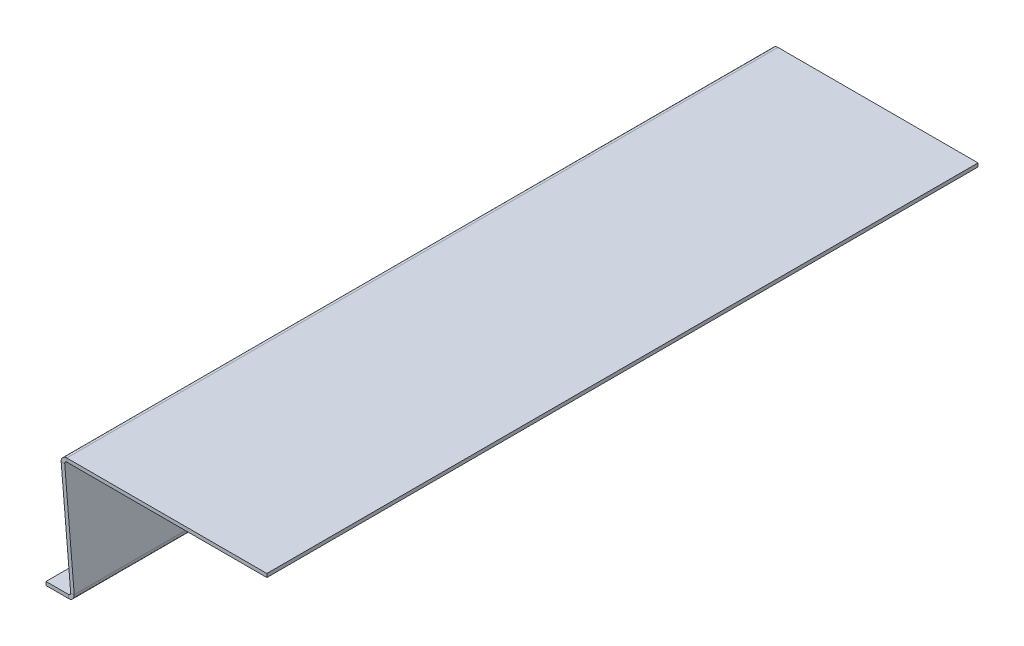
ISO-10303-21;
HEADER;
FILE_DESCRIPTION(('STEP AP214'),'2;1');
FILE_NAME('part.step','',(''),(''),'','','');
FILE_SCHEMA(('AUTOMOTIVE_DESIGN { 1 0 10303 214 1 1 1 1 }'));
ENDSEC;
DATA;
#1=APPLICATION_CONTEXT('core data for automotive mechanical design processes');
#2=APPLICATION_PROTOCOL_DEFINITION('international standard','automotive_design',2000,#1);
#3=PRODUCT_CONTEXT('',#1,'mechanical');
#4=PRODUCT('Part','Part','',(#3));
#5=PRODUCT_RELATED_PRODUCT_CATEGORY('part','',(#4));
#6=PRODUCT_DEFINITION_FORMATION('','',#4);
#7=PRODUCT_DEFINITION_CONTEXT('part definition',#1,'design');
#8=PRODUCT_DEFINITION('design','',#6,#7);
#9=PRODUCT_DEFINITION_SHAPE('','',#8);
#10=(LENGTH_UNIT() NAMED_UNIT(*) SI_UNIT(.MILLI.,.METRE.));
#11=(NAMED_UNIT(*) PLANE_ANGLE_UNIT() SI_UNIT($,.RADIAN.));
#12=(NAMED_UNIT(*) SI_UNIT($,.STERADIAN.) SOLID_ANGLE_UNIT());
#13=UNCERTAINTY_MEASURE_WITH_UNIT(LENGTH_MEASURE(1.E-05),#10,'distance_accuracy_value','');
#14=(GEOMETRIC_REPRESENTATION_CONTEXT(3) GLOBAL_UNCERTAINTY_ASSIGNED_CONTEXT((#13)) GLOBAL_UNIT_ASSIGNED_CONTEXT((#10,
#11,#12)) REPRESENTATION_CONTEXT('',''));
#15=CARTESIAN_POINT('',(0.,0.,0.));
#16=DIRECTION('',(0.,0.,1.));
#17=DIRECTION('',(1.,0.,0.));
#18=AXIS2_PLACEMENT_3D('',#15,#16,#17);
#19=CARTESIAN_POINT('',(-289.23908957618,-8.6972459419814,-1000.));
#20=DIRECTION('',(0.,0.,-1.));
#21=DIRECTION('',(-1.,0.,0.));
#22=AXIS2_PLACEMENT_3D('',#19,#20,#21);
#23=PLANE('',#22);
#24=DIRECTION('',(0.996194698091745,0.0871557427476611,0.));
#25=VECTOR('',#24,1.);
#26=CARTESIAN_POINT('',(-289.23908957618,-8.6972459419814,-1000.));
#27=LINE('',#26,#25);
#28=CARTESIAN_POINT('',(-289.23908957618,-8.6972459419814,-1000.));
#29=VERTEX_POINT('',#28);
#30=CARTESIAN_POINT('',(-284.258116085721,-8.26146722824306,-1000.));
#31=VERTEX_POINT('',#30);
#32=EDGE_CURVE('E13',#29,#31,#27,.T.);
#33=ORIENTED_EDGE('',*,*,#32,.F.);
#34=CARTESIAN_POINT('',(-281.269531991446,-8.00000000000001,-1000.));
#35=DIRECTION('',(0.,0.,-1.));
#36=DIRECTION('',(-1.,0.,0.));
#37=AXIS2_PLACEMENT_3D('',#34,#35,#36);
#38=CIRCLE('',#37,8.);
#39=CARTESIAN_POINT('',(-281.269531991446,0.,-1000.));
#40=VERTEX_POINT('',#39);
#41=EDGE_CURVE('E151',#40,#29,#38,.F.);
#42=ORIENTED_EDGE('',*,*,#41,.F.);
#43=DIRECTION('',(0.,1.,0.));
#44=VECTOR('',#43,1.);
#45=CARTESIAN_POINT('',(-281.269531991446,-4.99999999999989,-1000.));
#46=LINE('',#45,#44);
#47=CARTESIAN_POINT('',(-281.269531991446,-4.99999999999989,-1000.));
#48=VERTEX_POINT('',#47);
#49=EDGE_CURVE('E58',#48,#40,#46,.T.);
#50=ORIENTED_EDGE('',*,*,#49,.F.);
#51=CARTESIAN_POINT('',(-281.269531991446,-8.00000000000001,-1000.));
#52=DIRECTION('',(0.,0.,1.));
#53=DIRECTION('',(1.,0.,0.));
#54=AXIS2_PLACEMENT_3D('',#51,#52,#53);
#55=CIRCLE('',#54,3.);
#56=EDGE_CURVE('E154',#48,#31,#55,.T.);
#57=ORIENTED_EDGE('',*,*,#56,.T.);
#58=EDGE_LOOP('',(#33,#42,#50,#57));
#59=FACE_BOUND('',#58,.T.);
#60=ADVANCED_FACE('F50',(#59),#23,.T.);
#61=CARTESIAN_POINT('',(-281.269531991446,-4.99999999999989,-1000.));
#62=DIRECTION('',(0.,0.,-1.));
#63=DIRECTION('',(-1.,0.,0.));
#64=AXIS2_PLACEMENT_3D('',#61,#62,#63);
#65=PLANE('',#64);
#66=DIRECTION('',(0.0871557427476618,-0.996194698091745,0.));
#67=VECTOR('',#66,1.);
#68=CARTESIAN_POINT('',(-290.,0.,-1000.));
#69=LINE('',#68,#67);
#70=CARTESIAN_POINT('',(-275.849711927155,-161.738532771757,-1000.));
#71=VERTEX_POINT('',#70);
#72=EDGE_CURVE('E165',#29,#71,#69,.T.);
#73=ORIENTED_EDGE('',*,*,#72,.F.);
#74=ORIENTED_EDGE('',*,*,#32,.T.);
#75=DIRECTION('',(0.0871557427476618,-0.996194698091745,0.));
#76=VECTOR('',#75,1.);
#77=CARTESIAN_POINT('',(-285.019026509541,0.435778713738344,-1000.));
#78=LINE('',#77,#76);
#79=CARTESIAN_POINT('',(-270.868738436696,-161.302754058019,-1000.));
#80=VERTEX_POINT('',#79);
#81=EDGE_CURVE('E270',#31,#80,#78,.T.);
#82=ORIENTED_EDGE('',*,*,#81,.T.);
#83=DIRECTION('',(-0.996194698091747,-0.0871557427476402,0.));
#84=VECTOR('',#83,1.);
#85=CARTESIAN_POINT('',(-270.868738436696,-161.302754058019,-1000.));
#86=LINE('',#85,#84);
#87=EDGE_CURVE('E175',#80,#71,#86,.T.);
#88=ORIENTED_EDGE('',*,*,#87,.T.);
#89=EDGE_LOOP('',(#73,#74,#82,#88));
#90=FACE_BOUND('',#89,.T.);
#91=ADVANCED_FACE('F174',(#90),#65,.T.);
#92=CARTESIAN_POINT('',(-281.269531991446,0.,0.));
#93=DIRECTION('',(0.,0.,1.));
#94=DIRECTION('',(1.,0.,0.));
#95=AXIS2_PLACEMENT_3D('',#92,#93,#94);
#96=PLANE('',#95);
#97=DIRECTION('',(0.,-1.,0.));
#98=VECTOR('',#97,1.);
#99=CARTESIAN_POINT('',(-281.269531991446,0.,0.));
#100=LINE('',#99,#98);
#101=CARTESIAN_POINT('',(-281.269531991446,0.,0.));
#102=VERTEX_POINT('',#101);
#103=CARTESIAN_POINT('',(-281.269531991446,-4.99999999999989,0.));
#104=VERTEX_POINT('',#103);
#105=EDGE_CURVE('E252',#102,#104,#100,.T.);
#106=ORIENTED_EDGE('',*,*,#105,.F.);
#107=CARTESIAN_POINT('',(-281.269531991446,-8.00000000000001,0.));
#108=DIRECTION('',(0.,0.,-1.));
#109=DIRECTION('',(-1.,0.,0.));
#110=AXIS2_PLACEMENT_3D('',#107,#108,#109);
#111=CIRCLE('',#110,8.);
#112=CARTESIAN_POINT('',(-289.23908957618,-8.6972459419814,0.));
#113=VERTEX_POINT('',#112);
#114=EDGE_CURVE('E215',#102,#113,#111,.F.);
#115=ORIENTED_EDGE('',*,*,#114,.T.);
#116=DIRECTION('',(-0.996194698091745,-0.0871557427476611,0.));
#117=VECTOR('',#116,1.);
#118=CARTESIAN_POINT('',(-284.258116085721,-8.26146722824306,0.));
#119=LINE('',#118,#117);
#120=CARTESIAN_POINT('',(-284.258116085721,-8.26146722824306,0.));
#121=VERTEX_POINT('',#120);
#122=EDGE_CURVE('E250',#121,#113,#119,.T.);
#123=ORIENTED_EDGE('',*,*,#122,.F.);
#124=CARTESIAN_POINT('',(-281.269531991446,-8.00000000000001,0.));
#125=DIRECTION('',(0.,0.,1.));
#126=DIRECTION('',(1.,0.,0.));
#127=AXIS2_PLACEMENT_3D('',#124,#125,#126);
#128=CIRCLE('',#127,3.);
#129=EDGE_CURVE('E204',#104,#121,#128,.T.);
#130=ORIENTED_EDGE('',*,*,#129,.F.);
#131=EDGE_LOOP('',(#106,#115,#123,#130));
#132=FACE_BOUND('',#131,.T.);
#133=ADVANCED_FACE('F319',(#132),#96,.T.);
#134=CARTESIAN_POINT('',(-284.258116085721,-8.26146722824306,0.));
#135=DIRECTION('',(0.,0.,1.));
#136=DIRECTION('',(1.,0.,0.));
#137=AXIS2_PLACEMENT_3D('',#134,#135,#136);
#138=PLANE('',#137);
#139=DIRECTION('',(-1.,0.,0.));
#140=VECTOR('',#139,1.);
#141=CARTESIAN_POINT('',(0.,0.,0.));
#142=LINE('',#141,#140);
#143=CARTESIAN_POINT('',(0.,0.,0.));
#144=VERTEX_POINT('',#143);
#145=EDGE_CURVE('E212',#144,#102,#142,.T.);
#146=ORIENTED_EDGE('',*,*,#145,.T.);
#147=ORIENTED_EDGE('',*,*,#105,.T.);
#148=DIRECTION('',(1.,0.,0.));
#149=VECTOR('',#148,1.);
#150=CARTESIAN_POINT('',(0.,-4.99999999999989,0.));
#151=LINE('',#150,#149);
#152=CARTESIAN_POINT('',(0.,-4.99999999999989,0.));
#153=VERTEX_POINT('',#152);
#154=EDGE_CURVE('E207',#153,#104,#151,.F.);
#155=ORIENTED_EDGE('',*,*,#154,.F.);
#156=DIRECTION('',(0.,-1.,0.));
#157=VECTOR('',#156,1.);
#158=CARTESIAN_POINT('',(0.,0.,0.));
#159=LINE('',#158,#157);
#160=EDGE_CURVE('E210',#144,#153,#159,.T.);
#161=ORIENTED_EDGE('',*,*,#160,.F.);
#162=EDGE_LOOP('',(#146,#147,#155,#161));
#163=FACE_BOUND('',#162,.T.);
#164=ADVANCED_FACE('F323',(#163),#138,.T.);
#165=CARTESIAN_POINT('',(-278.83829602143,-165.,-1000.));
#166=DIRECTION('',(0.,0.,-1.));
#167=DIRECTION('',(-1.,0.,0.));
#168=AXIS2_PLACEMENT_3D('',#165,#166,#167);
#169=PLANE('',#168);
#170=DIRECTION('',(0.,-1.,0.));
#171=VECTOR('',#170,1.);
#172=CARTESIAN_POINT('',(-278.83829602143,-165.,-1000.));
#173=LINE('',#172,#171);
#174=CARTESIAN_POINT('',(-278.83829602143,-165.,-1000.));
#175=VERTEX_POINT('',#174);
#176=CARTESIAN_POINT('',(-278.83829602143,-170.,-1000.));
#177=VERTEX_POINT('',#176);
#178=EDGE_CURVE('E66',#175,#177,#173,.T.);
#179=ORIENTED_EDGE('',*,*,#178,.F.);
#180=CARTESIAN_POINT('',(-278.83829602143,-162.,-1000.));
#181=DIRECTION('',(0.,0.,1.));
#182=DIRECTION('',(1.,0.,0.));
#183=AXIS2_PLACEMENT_3D('',#180,#181,#182);
#184=CIRCLE('',#183,3.);
#185=EDGE_CURVE('E177',#71,#175,#184,.F.);
#186=ORIENTED_EDGE('',*,*,#185,.F.);
#187=ORIENTED_EDGE('',*,*,#87,.F.);
#188=CARTESIAN_POINT('',(-278.83829602143,-162.,-1000.));
#189=DIRECTION('',(0.,0.,1.));
#190=DIRECTION('',(1.,0.,0.));
#191=AXIS2_PLACEMENT_3D('',#188,#189,#190);
#192=CIRCLE('',#191,8.);
#193=EDGE_CURVE('E272',#80,#177,#192,.F.);
#194=ORIENTED_EDGE('',*,*,#193,.T.);
#195=EDGE_LOOP('',(#179,#186,#187,#194));
#196=FACE_BOUND('',#195,.T.);
#197=ADVANCED_FACE('F287',(#196),#169,.T.);
#198=CARTESIAN_POINT('',(-270.868738436696,-161.302754058019,-1000.));
#199=DIRECTION('',(0.,0.,-1.));
#200=DIRECTION('',(-1.,0.,0.));
#201=AXIS2_PLACEMENT_3D('',#198,#199,#200);
#202=PLANE('',#201);
#203=DIRECTION('',(-1.,0.,0.));
#204=VECTOR('',#203,1.);
#205=CARTESIAN_POINT('',(-275.564370518222,-165.,-1000.));
#206=LINE('',#205,#204);
#207=CARTESIAN_POINT('',(-310.564370518222,-165.,-1000.));
#208=VERTEX_POINT('',#207);
#209=EDGE_CURVE('E220',#175,#208,#206,.T.);
#210=ORIENTED_EDGE('',*,*,#209,.F.);
#211=ORIENTED_EDGE('',*,*,#178,.T.);
#212=DIRECTION('',(-1.,0.,0.));
#213=VECTOR('',#212,1.);
#214=CARTESIAN_POINT('',(-275.564370518222,-170.,-1000.));
#215=LINE('',#214,#213);
#216=CARTESIAN_POINT('',(-310.564370518222,-170.,-1000.));
#217=VERTEX_POINT('',#216);
#218=EDGE_CURVE('E276',#177,#217,#215,.T.);
#219=ORIENTED_EDGE('',*,*,#218,.T.);
#220=DIRECTION('',(0.,1.,0.));
#221=VECTOR('',#220,1.);
#222=CARTESIAN_POINT('',(-310.564370518222,-170.,-1000.));
#223=LINE('',#222,#221);
#224=EDGE_CURVE('E123',#217,#208,#223,.T.);
#225=ORIENTED_EDGE('',*,*,#224,.T.);
#226=EDGE_LOOP('',(#210,#211,#219,#225));
#227=FACE_BOUND('',#226,.T.);
#228=ADVANCED_FACE('F283',(#227),#202,.T.);
#229=CARTESIAN_POINT('',(-275.849711927155,-161.738532771757,0.));
#230=DIRECTION('',(0.,0.,1.));
#231=DIRECTION('',(1.,0.,0.));
#232=AXIS2_PLACEMENT_3D('',#229,#230,#231);
#233=PLANE('',#232);
#234=DIRECTION('',(0.996194698091747,0.0871557427476402,0.));
#235=VECTOR('',#234,1.);
#236=CARTESIAN_POINT('',(-275.849711927155,-161.738532771757,0.));
#237=LINE('',#236,#235);
#238=CARTESIAN_POINT('',(-275.849711927155,-161.738532771757,0.));
#239=VERTEX_POINT('',#238);
#240=CARTESIAN_POINT('',(-270.868738436696,-161.302754058019,0.));
#241=VERTEX_POINT('',#240);
#242=EDGE_CURVE('E107',#239,#241,#237,.T.);
#243=ORIENTED_EDGE('',*,*,#242,.F.);
#244=CARTESIAN_POINT('',(-278.83829602143,-162.,0.));
#245=DIRECTION('',(0.,0.,1.));
#246=DIRECTION('',(1.,0.,0.));
#247=AXIS2_PLACEMENT_3D('',#244,#245,#246);
#248=CIRCLE('',#247,3.);
#249=CARTESIAN_POINT('',(-278.83829602143,-165.,0.));
#250=VERTEX_POINT('',#249);
#251=EDGE_CURVE('E218',#239,#250,#248,.F.);
#252=ORIENTED_EDGE('',*,*,#251,.T.);
#253=DIRECTION('',(0.,1.,0.));
#254=VECTOR('',#253,1.);
#255=CARTESIAN_POINT('',(-278.83829602143,-170.,0.));
#256=LINE('',#255,#254);
#257=CARTESIAN_POINT('',(-278.83829602143,-170.,0.));
#258=VERTEX_POINT('',#257);
#259=EDGE_CURVE('E114',#258,#250,#256,.T.);
#260=ORIENTED_EDGE('',*,*,#259,.F.);
#261=CARTESIAN_POINT('',(-278.83829602143,-162.,0.));
#262=DIRECTION('',(0.,0.,1.));
#263=DIRECTION('',(1.,0.,0.));
#264=AXIS2_PLACEMENT_3D('',#261,#262,#263);
#265=CIRCLE('',#264,8.);
#266=EDGE_CURVE('E198',#241,#258,#265,.F.);
#267=ORIENTED_EDGE('',*,*,#266,.F.);
#268=EDGE_LOOP('',(#243,#252,#260,#267));
#269=FACE_BOUND('',#268,.T.);
#270=ADVANCED_FACE('F304',(#269),#233,.T.);
#271=CARTESIAN_POINT('',(-278.83829602143,-170.,0.));
#272=DIRECTION('',(0.,0.,1.));
#273=DIRECTION('',(1.,0.,0.));
#274=AXIS2_PLACEMENT_3D('',#271,#272,#273);
#275=PLANE('',#274);
#276=DIRECTION('',(0.0871557427476618,-0.996194698091745,0.));
#277=VECTOR('',#276,1.);
#278=CARTESIAN_POINT('',(-290.,0.,0.));
#279=LINE('',#278,#277);
#280=EDGE_CURVE('E167',#113,#239,#279,.T.);
#281=ORIENTED_EDGE('',*,*,#280,.T.);
#282=ORIENTED_EDGE('',*,*,#242,.T.);
#283=DIRECTION('',(0.0871557427476618,-0.996194698091745,0.));
#284=VECTOR('',#283,1.);
#285=CARTESIAN_POINT('',(-285.019026509541,0.435778713738344,0.));
#286=LINE('',#285,#284);
#287=EDGE_CURVE('E201',#121,#241,#286,.T.);
#288=ORIENTED_EDGE('',*,*,#287,.F.);
#289=ORIENTED_EDGE('',*,*,#122,.T.);
#290=EDGE_LOOP('',(#281,#282,#288,#289));
#291=FACE_BOUND('',#290,.T.);
#292=ADVANCED_FACE('F306',(#291),#275,.T.);
#293=CARTESIAN_POINT('',(-275.564370518222,-165.,-1000.));
#294=DIRECTION('',(0.,1.,0.));
#295=DIRECTION('',(-1.,0.,0.));
#296=AXIS2_PLACEMENT_3D('',#293,#294,#295);
#297=PLANE('',#296);
#298=DIRECTION('',(-1.,0.,0.));
#299=VECTOR('',#298,1.);
#300=CARTESIAN_POINT('',(-275.564370518222,-165.,0.));
#301=LINE('',#300,#299);
#302=CARTESIAN_POINT('',(-310.564370518222,-165.,0.));
#303=VERTEX_POINT('',#302);
#304=EDGE_CURVE('E191',#250,#303,#301,.T.);
#305=ORIENTED_EDGE('',*,*,#304,.F.);
#306=DIRECTION('',(0.,0.,1.));
#307=VECTOR('',#306,1.);
#308=CARTESIAN_POINT('',(-278.83829602143,-165.,-1000.));
#309=LINE('',#308,#307);
#310=EDGE_CURVE('E221',#175,#250,#309,.T.);
#311=ORIENTED_EDGE('',*,*,#310,.F.);
#312=ORIENTED_EDGE('',*,*,#209,.T.);
#313=DIRECTION('',(0.,0.,1.));
#314=VECTOR('',#313,1.);
#315=CARTESIAN_POINT('',(-310.564370518222,-165.,-1000.));
#316=LINE('',#315,#314);
#317=EDGE_CURVE('E190',#208,#303,#316,.T.);
#318=ORIENTED_EDGE('',*,*,#317,.T.);
#319=EDGE_LOOP('',(#305,#311,#312,#318));
#320=FACE_BOUND('',#319,.T.);
#321=ADVANCED_FACE('F282',(#320),#297,.T.);
#322=CARTESIAN_POINT('',(-278.83829602143,-162.,-1000.));
#323=DIRECTION('',(0.,0.,1.));
#324=DIRECTION('',(1.,0.,0.));
#325=AXIS2_PLACEMENT_3D('',#322,#323,#324);
#326=CYLINDRICAL_SURFACE('',#325,3.);
#327=ORIENTED_EDGE('',*,*,#251,.F.);
#328=DIRECTION('',(0.,0.,1.));
#329=VECTOR('',#328,1.);
#330=CARTESIAN_POINT('',(-275.849711927155,-161.738532771757,-1000.));
#331=LINE('',#330,#329);
#332=EDGE_CURVE('E171',#71,#239,#331,.T.);
#333=ORIENTED_EDGE('',*,*,#332,.F.);
#334=ORIENTED_EDGE('',*,*,#185,.T.);
#335=ORIENTED_EDGE('',*,*,#310,.T.);
#336=EDGE_LOOP('',(#327,#333,#334,#335));
#337=FACE_BOUND('',#336,.T.);
#338=ADVANCED_FACE('F286',(#337),#326,.F.);
#339=CARTESIAN_POINT('',(-290.,0.,-1000.));
#340=DIRECTION('',(-0.996194698091745,-0.0871557427476618,0.));
#341=DIRECTION('',(0.0871557427476618,-0.996194698091745,0.));
#342=AXIS2_PLACEMENT_3D('',#339,#340,#341);
#343=PLANE('',#342);
#344=ORIENTED_EDGE('',*,*,#280,.F.);
#345=DIRECTION('',(0.,0.,1.));
#346=VECTOR('',#345,1.);
#347=CARTESIAN_POINT('',(-289.23908957618,-8.6972459419814,-1000.));
#348=LINE('',#347,#346);
#349=EDGE_CURVE('E163',#29,#113,#348,.T.);
#350=ORIENTED_EDGE('',*,*,#349,.F.);
#351=ORIENTED_EDGE('',*,*,#72,.T.);
#352=ORIENTED_EDGE('',*,*,#332,.T.);
#353=EDGE_LOOP('',(#344,#350,#351,#352));
#354=FACE_BOUND('',#353,.T.);
#355=ADVANCED_FACE('F164',(#354),#343,.T.);
#356=CARTESIAN_POINT('',(-281.269531991446,-8.00000000000001,-1000.));
#357=DIRECTION('',(0.,0.,1.));
#358=DIRECTION('',(1.,0.,0.));
#359=AXIS2_PLACEMENT_3D('',#356,#357,#358);
#360=CYLINDRICAL_SURFACE('',#359,8.);
#361=ORIENTED_EDGE('',*,*,#114,.F.);
#362=DIRECTION('',(0.,0.,1.));
#363=VECTOR('',#362,1.);
#364=CARTESIAN_POINT('',(-281.269531991446,0.,-1000.));
#365=LINE('',#364,#363);
#366=EDGE_CURVE('E172',#40,#102,#365,.T.);
#367=ORIENTED_EDGE('',*,*,#366,.F.);
#368=ORIENTED_EDGE('',*,*,#41,.T.);
#369=ORIENTED_EDGE('',*,*,#349,.T.);
#370=EDGE_LOOP('',(#361,#367,#368,#369));
#371=FACE_BOUND('',#370,.T.);
#372=ADVANCED_FACE('F180',(#371),#360,.T.);
#373=CARTESIAN_POINT('',(0.,0.,-1000.));
#374=DIRECTION('',(0.,1.,0.));
#375=DIRECTION('',(0.,0.,1.));
#376=AXIS2_PLACEMENT_3D('',#373,#374,#375);
#377=PLANE('',#376);
#378=ORIENTED_EDGE('',*,*,#145,.F.);
#379=DIRECTION('',(0.,0.,1.));
#380=VECTOR('',#379,1.);
#381=CARTESIAN_POINT('',(0.,0.,-1000.));
#382=LINE('',#381,#380);
#383=CARTESIAN_POINT('',(0.,0.,-1000.));
#384=VERTEX_POINT('',#383);
#385=EDGE_CURVE('E225',#384,#144,#382,.T.);
#386=ORIENTED_EDGE('',*,*,#385,.F.);
#387=DIRECTION('',(-1.,0.,0.));
#388=VECTOR('',#387,1.);
#389=CARTESIAN_POINT('',(0.,0.,-1000.));
#390=LINE('',#389,#388);
#391=EDGE_CURVE('E182',#384,#40,#390,.T.);
#392=ORIENTED_EDGE('',*,*,#391,.T.);
#393=ORIENTED_EDGE('',*,*,#366,.T.);
#394=EDGE_LOOP('',(#378,#386,#392,#393));
#395=FACE_BOUND('',#394,.T.);
#396=ADVANCED_FACE('F388',(#395),#377,.T.);
#397=CARTESIAN_POINT('',(0.,0.,-1000.));
#398=DIRECTION('',(-1.,0.,0.));
#399=DIRECTION('',(0.,0.,1.));
#400=AXIS2_PLACEMENT_3D('',#397,#398,#399);
#401=PLANE('',#400);
#402=ORIENTED_EDGE('',*,*,#160,.T.);
#403=DIRECTION('',(0.,0.,1.));
#404=VECTOR('',#403,1.);
#405=CARTESIAN_POINT('',(0.,-4.99999999999989,-1000.));
#406=LINE('',#405,#404);
#407=CARTESIAN_POINT('',(0.,-4.99999999999989,-1000.));
#408=VERTEX_POINT('',#407);
#409=EDGE_CURVE('E227',#408,#153,#406,.T.);
#410=ORIENTED_EDGE('',*,*,#409,.F.);
#411=DIRECTION('',(0.,-1.,0.));
#412=VECTOR('',#411,1.);
#413=CARTESIAN_POINT('',(0.,0.,-1000.));
#414=LINE('',#413,#412);
#415=EDGE_CURVE('E184',#384,#408,#414,.T.);
#416=ORIENTED_EDGE('',*,*,#415,.F.);
#417=ORIENTED_EDGE('',*,*,#385,.T.);
#418=EDGE_LOOP('',(#402,#410,#416,#417));
#419=FACE_BOUND('',#418,.T.);
#420=ADVANCED_FACE('F398',(#419),#401,.F.);
#421=CARTESIAN_POINT('',(0.,-4.99999999999989,-1000.));
#422=DIRECTION('',(0.,1.,0.));
#423=DIRECTION('',(0.,0.,1.));
#424=AXIS2_PLACEMENT_3D('',#421,#422,#423);
#425=PLANE('',#424);
#426=ORIENTED_EDGE('',*,*,#154,.T.);
#427=DIRECTION('',(0.,0.,1.));
#428=VECTOR('',#427,1.);
#429=CARTESIAN_POINT('',(-281.269531991446,-4.99999999999989,-1000.));
#430=LINE('',#429,#428);
#431=EDGE_CURVE('E230',#48,#104,#430,.T.);
#432=ORIENTED_EDGE('',*,*,#431,.F.);
#433=DIRECTION('',(1.,0.,0.));
#434=VECTOR('',#433,1.);
#435=CARTESIAN_POINT('',(0.,-4.99999999999989,-1000.));
#436=LINE('',#435,#434);
#437=EDGE_CURVE('E258',#408,#48,#436,.F.);
#438=ORIENTED_EDGE('',*,*,#437,.F.);
#439=ORIENTED_EDGE('',*,*,#409,.T.);
#440=EDGE_LOOP('',(#426,#432,#438,#439));
#441=FACE_BOUND('',#440,.T.);
#442=ADVANCED_FACE('F264',(#441),#425,.F.);
#443=CARTESIAN_POINT('',(-281.269531991446,-8.00000000000001,-1000.));
#444=DIRECTION('',(0.,0.,1.));
#445=DIRECTION('',(1.,0.,0.));
#446=AXIS2_PLACEMENT_3D('',#443,#444,#445);
#447=CYLINDRICAL_SURFACE('',#446,3.);
#448=ORIENTED_EDGE('',*,*,#129,.T.);
#449=DIRECTION('',(0.,0.,1.));
#450=VECTOR('',#449,1.);
#451=CARTESIAN_POINT('',(-284.258116085721,-8.26146722824306,-1000.));
#452=LINE('',#451,#450);
#453=EDGE_CURVE('E233',#31,#121,#452,.T.);
#454=ORIENTED_EDGE('',*,*,#453,.F.);
#455=ORIENTED_EDGE('',*,*,#56,.F.);
#456=ORIENTED_EDGE('',*,*,#431,.T.);
#457=EDGE_LOOP('',(#448,#454,#455,#456));
#458=FACE_BOUND('',#457,.T.);
#459=ADVANCED_FACE('F268',(#458),#447,.F.);
#460=CARTESIAN_POINT('',(-285.019026509541,0.435778713738344,-1000.));
#461=DIRECTION('',(-0.996194698091745,-0.0871557427476618,0.));
#462=DIRECTION('',(0.0871557427476618,-0.996194698091745,0.));
#463=AXIS2_PLACEMENT_3D('',#460,#461,#462);
#464=PLANE('',#463);
#465=ORIENTED_EDGE('',*,*,#287,.T.);
#466=DIRECTION('',(0.,0.,1.));
#467=VECTOR('',#466,1.);
#468=CARTESIAN_POINT('',(-270.868738436696,-161.302754058019,-1000.));
#469=LINE('',#468,#467);
#470=EDGE_CURVE('E236',#80,#241,#469,.T.);
#471=ORIENTED_EDGE('',*,*,#470,.F.);
#472=ORIENTED_EDGE('',*,*,#81,.F.);
#473=ORIENTED_EDGE('',*,*,#453,.T.);
#474=EDGE_LOOP('',(#465,#471,#472,#473));
#475=FACE_BOUND('',#474,.T.);
#476=ADVANCED_FACE('F292',(#475),#464,.F.);
#477=CARTESIAN_POINT('',(-278.83829602143,-162.,-1000.));
#478=DIRECTION('',(0.,0.,1.));
#479=DIRECTION('',(1.,0.,0.));
#480=AXIS2_PLACEMENT_3D('',#477,#478,#479);
#481=CYLINDRICAL_SURFACE('',#480,8.);
#482=ORIENTED_EDGE('',*,*,#266,.T.);
#483=DIRECTION('',(0.,0.,1.));
#484=VECTOR('',#483,1.);
#485=CARTESIAN_POINT('',(-278.83829602143,-170.,-1000.));
#486=LINE('',#485,#484);
#487=EDGE_CURVE('E239',#177,#258,#486,.T.);
#488=ORIENTED_EDGE('',*,*,#487,.F.);
#489=ORIENTED_EDGE('',*,*,#193,.F.);
#490=ORIENTED_EDGE('',*,*,#470,.T.);
#491=EDGE_LOOP('',(#482,#488,#489,#490));
#492=FACE_BOUND('',#491,.T.);
#493=ADVANCED_FACE('F295',(#492),#481,.T.);
#494=CARTESIAN_POINT('',(-275.564370518222,-170.,-1000.));
#495=DIRECTION('',(0.,1.,0.));
#496=DIRECTION('',(-1.,0.,0.));
#497=AXIS2_PLACEMENT_3D('',#494,#495,#496);
#498=PLANE('',#497);
#499=DIRECTION('',(-1.,0.,0.));
#500=VECTOR('',#499,1.);
#501=CARTESIAN_POINT('',(-275.564370518222,-170.,0.));
#502=LINE('',#501,#500);
#503=CARTESIAN_POINT('',(-310.564370518222,-170.,0.));
#504=VERTEX_POINT('',#503);
#505=EDGE_CURVE('E196',#258,#504,#502,.T.);
#506=ORIENTED_EDGE('',*,*,#505,.T.);
#507=DIRECTION('',(0.,0.,1.));
#508=VECTOR('',#507,1.);
#509=CARTESIAN_POINT('',(-310.564370518222,-170.,-1000.));
#510=LINE('',#509,#508);
#511=EDGE_CURVE('E242',#217,#504,#510,.T.);
#512=ORIENTED_EDGE('',*,*,#511,.F.);
#513=ORIENTED_EDGE('',*,*,#218,.F.);
#514=ORIENTED_EDGE('',*,*,#487,.T.);
#515=EDGE_LOOP('',(#506,#512,#513,#514));
#516=FACE_BOUND('',#515,.T.);
#517=ADVANCED_FACE('F299',(#516),#498,.F.);
#518=CARTESIAN_POINT('',(-310.564370518222,-170.,-1000.));
#519=DIRECTION('',(1.,0.,0.));
#520=DIRECTION('',(0.,0.,-1.));
#521=AXIS2_PLACEMENT_3D('',#518,#519,#520);
#522=PLANE('',#521);
#523=DIRECTION('',(0.,1.,0.));
#524=VECTOR('',#523,1.);
#525=CARTESIAN_POINT('',(-310.564370518222,-170.,0.));
#526=LINE('',#525,#524);
#527=EDGE_CURVE('E193',#504,#303,#526,.T.);
#528=ORIENTED_EDGE('',*,*,#527,.T.);
#529=ORIENTED_EDGE('',*,*,#317,.F.);
#530=ORIENTED_EDGE('',*,*,#224,.F.);
#531=ORIENTED_EDGE('',*,*,#511,.T.);
#532=EDGE_LOOP('',(#528,#529,#530,#531));
#533=FACE_BOUND('',#532,.T.);
#534=ADVANCED_FACE('F302',(#533),#522,.F.);
#535=CARTESIAN_POINT('',(-278.83829602143,-162.,-1000.));
#536=DIRECTION('',(0.,0.,1.));
#537=DIRECTION('',(1.,0.,0.));
#538=AXIS2_PLACEMENT_3D('',#535,#536,#537);
#539=PLANE('',#538);
#540=ORIENTED_EDGE('',*,*,#437,.T.);
#541=ORIENTED_EDGE('',*,*,#49,.T.);
#542=ORIENTED_EDGE('',*,*,#391,.F.);
#543=ORIENTED_EDGE('',*,*,#415,.T.);
#544=EDGE_LOOP('',(#540,#541,#542,#543));
#545=FACE_BOUND('',#544,.T.);
#546=ADVANCED_FACE('F256',(#545),#539,.F.);
#547=CARTESIAN_POINT('',(-278.83829602143,-162.,0.));
#548=DIRECTION('',(0.,0.,1.));
#549=DIRECTION('',(1.,0.,0.));
#550=AXIS2_PLACEMENT_3D('',#547,#548,#549);
#551=PLANE('',#550);
#552=ORIENTED_EDGE('',*,*,#304,.T.);
#553=ORIENTED_EDGE('',*,*,#527,.F.);
#554=ORIENTED_EDGE('',*,*,#505,.F.);
#555=ORIENTED_EDGE('',*,*,#259,.T.);
#556=EDGE_LOOP('',(#552,#553,#554,#555));
#557=FACE_BOUND('',#556,.T.);
#558=ADVANCED_FACE('F303',(#557),#551,.T.);
#559=CLOSED_SHELL('',(#60,#91,#133,#164,#197,#228,#270,#292,#321,#338,#355,#372,#396,#420,#442,
#459,#476,#493,#517,#534,#546,#558));
#560=MANIFOLD_SOLID_BREP('B2',#559);
#561=ADVANCED_BREP_SHAPE_REPRESENTATION('',(#18,#560),#14);
#562=SHAPE_DEFINITION_REPRESENTATION(#9,#561);
ENDSEC;
END-ISO-10303-21;
